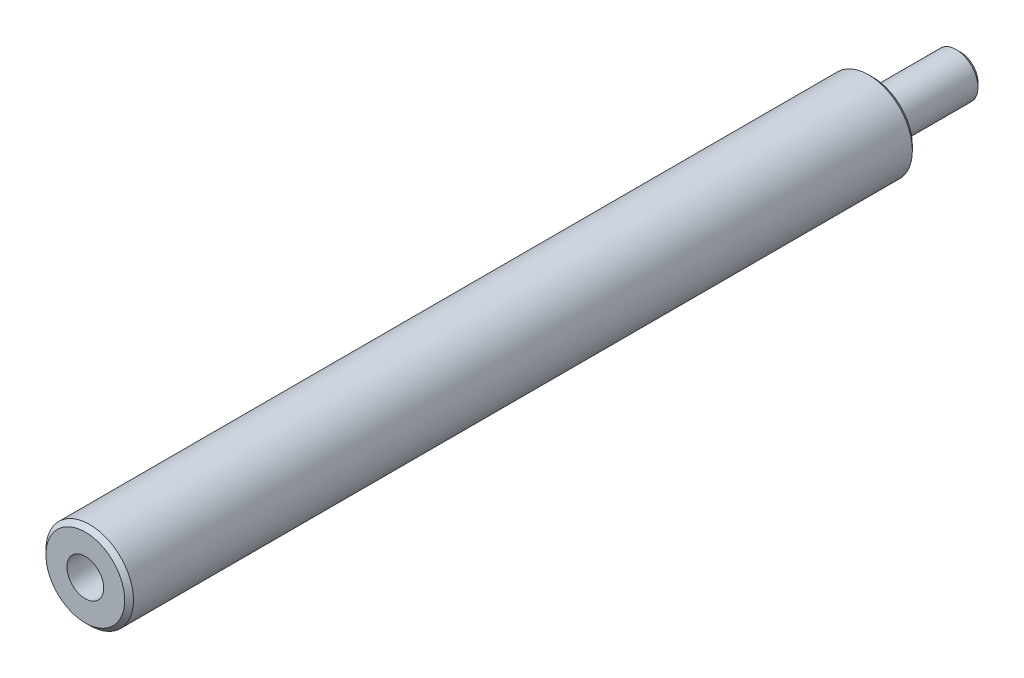
ISO-10303-21;
HEADER;
FILE_DESCRIPTION(('STEP AP214'),'2;1');
FILE_NAME('part.step','',(''),(''),'','','');
FILE_SCHEMA(('AUTOMOTIVE_DESIGN { 1 0 10303 214 1 1 1 1 }'));
ENDSEC;
DATA;
#1=APPLICATION_CONTEXT('core data for automotive mechanical design processes');
#2=APPLICATION_PROTOCOL_DEFINITION('international standard','automotive_design',2000,#1);
#3=PRODUCT_CONTEXT('',#1,'mechanical');
#4=PRODUCT('Part','Part','',(#3));
#5=PRODUCT_RELATED_PRODUCT_CATEGORY('part','',(#4));
#6=PRODUCT_DEFINITION_FORMATION('','',#4);
#7=PRODUCT_DEFINITION_CONTEXT('part definition',#1,'design');
#8=PRODUCT_DEFINITION('design','',#6,#7);
#9=PRODUCT_DEFINITION_SHAPE('','',#8);
#10=(LENGTH_UNIT() NAMED_UNIT(*) SI_UNIT(.MILLI.,.METRE.));
#11=(NAMED_UNIT(*) PLANE_ANGLE_UNIT() SI_UNIT($,.RADIAN.));
#12=(NAMED_UNIT(*) SI_UNIT($,.STERADIAN.) SOLID_ANGLE_UNIT());
#13=UNCERTAINTY_MEASURE_WITH_UNIT(LENGTH_MEASURE(1.E-05),#10,'distance_accuracy_value','');
#14=(GEOMETRIC_REPRESENTATION_CONTEXT(3) GLOBAL_UNCERTAINTY_ASSIGNED_CONTEXT((#13)) GLOBAL_UNIT_ASSIGNED_CONTEXT((#10,
#11,#12)) REPRESENTATION_CONTEXT('',''));
#15=CARTESIAN_POINT('',(0.,0.,0.));
#16=DIRECTION('',(0.,0.,1.));
#17=DIRECTION('',(1.,0.,0.));
#18=AXIS2_PLACEMENT_3D('',#15,#16,#17);
#19=CARTESIAN_POINT('',(0.,0.,90.));
#20=DIRECTION('',(0.,0.,-1.));
#21=DIRECTION('',(-1.,0.,0.));
#22=AXIS2_PLACEMENT_3D('',#19,#20,#21);
#23=CYLINDRICAL_SURFACE('',#22,5.);
#24=CARTESIAN_POINT('',(0.,0.,0.500000000000084));
#25=DIRECTION('',(0.,0.,1.));
#26=DIRECTION('',(1.,0.,0.));
#27=AXIS2_PLACEMENT_3D('',#24,#25,#26);
#28=CIRCLE('',#27,5.);
#29=CARTESIAN_POINT('',(5.,0.,0.500000000000084));
#30=VERTEX_POINT('',#29);
#31=EDGE_CURVE('E71',#30,#30,#28,.T.);
#32=ORIENTED_EDGE('',*,*,#31,.T.);
#33=EDGE_LOOP('',(#32));
#34=FACE_BOUND('',#33,.T.);
#35=CARTESIAN_POINT('',(0.,0.,89.5000000000001));
#36=DIRECTION('',(0.,0.,1.));
#37=DIRECTION('',(1.,0.,0.));
#38=AXIS2_PLACEMENT_3D('',#35,#36,#37);
#39=CIRCLE('',#38,5.);
#40=CARTESIAN_POINT('',(5.,0.,89.5000000000001));
#41=VERTEX_POINT('',#40);
#42=EDGE_CURVE('E68',#41,#41,#39,.F.);
#43=ORIENTED_EDGE('',*,*,#42,.T.);
#44=EDGE_LOOP('',(#43));
#45=FACE_BOUND('',#44,.T.);
#46=ADVANCED_FACE('F34',(#34,#45),#23,.T.);
#47=CARTESIAN_POINT('',(0.,0.,90.));
#48=DIRECTION('',(0.,0.,1.));
#49=DIRECTION('',(1.,0.,0.));
#50=AXIS2_PLACEMENT_3D('',#47,#48,#49);
#51=PLANE('',#50);
#52=CARTESIAN_POINT('',(0.,0.,90.));
#53=DIRECTION('',(0.,0.,1.));
#54=DIRECTION('',(1.,0.,0.));
#55=AXIS2_PLACEMENT_3D('',#52,#53,#54);
#56=CIRCLE('',#55,4.50000000000007);
#57=CARTESIAN_POINT('',(4.50000000000007,0.,90.));
#58=VERTEX_POINT('',#57);
#59=EDGE_CURVE('E11',#58,#58,#56,.T.);
#60=ORIENTED_EDGE('',*,*,#59,.T.);
#61=EDGE_LOOP('',(#60));
#62=FACE_BOUND('',#61,.T.);
#63=CARTESIAN_POINT('',(0.,0.,90.));
#64=DIRECTION('',(0.,0.,1.));
#65=DIRECTION('',(1.,0.,0.));
#66=AXIS2_PLACEMENT_3D('',#63,#64,#65);
#67=CIRCLE('',#66,2.1);
#68=CARTESIAN_POINT('',(2.1,0.,90.));
#69=VERTEX_POINT('',#68);
#70=EDGE_CURVE('E55',#69,#69,#67,.T.);
#71=ORIENTED_EDGE('',*,*,#70,.F.);
#72=EDGE_LOOP('',(#71));
#73=FACE_BOUND('',#72,.T.);
#74=ADVANCED_FACE('F87',(#62,#73),#51,.T.);
#75=CARTESIAN_POINT('',(0.,0.,0.));
#76=DIRECTION('',(0.,0.,1.));
#77=DIRECTION('',(1.,0.,0.));
#78=AXIS2_PLACEMENT_3D('',#75,#76,#77);
#79=PLANE('',#78);
#80=CARTESIAN_POINT('',(0.,0.,0.));
#81=DIRECTION('',(0.,0.,1.));
#82=DIRECTION('',(1.,0.,0.));
#83=AXIS2_PLACEMENT_3D('',#80,#81,#82);
#84=CIRCLE('',#83,4.49999999999991);
#85=CARTESIAN_POINT('',(4.49999999999991,0.,0.));
#86=VERTEX_POINT('',#85);
#87=EDGE_CURVE('E41',#86,#86,#84,.F.);
#88=ORIENTED_EDGE('',*,*,#87,.T.);
#89=EDGE_LOOP('',(#88));
#90=FACE_BOUND('',#89,.T.);
#91=CARTESIAN_POINT('',(0.,0.,0.));
#92=DIRECTION('',(0.,0.,-1.));
#93=DIRECTION('',(-1.,0.,0.));
#94=AXIS2_PLACEMENT_3D('',#91,#92,#93);
#95=CIRCLE('',#94,2.5);
#96=CARTESIAN_POINT('',(-2.5,0.,0.));
#97=VERTEX_POINT('',#96);
#98=EDGE_CURVE('E54',#97,#97,#95,.T.);
#99=ORIENTED_EDGE('',*,*,#98,.F.);
#100=EDGE_LOOP('',(#99));
#101=FACE_BOUND('',#100,.T.);
#102=ADVANCED_FACE('F76',(#90,#101),#79,.F.);
#103=CARTESIAN_POINT('',(0.,0.,-10.));
#104=DIRECTION('',(0.,0.,1.));
#105=DIRECTION('',(1.,0.,0.));
#106=AXIS2_PLACEMENT_3D('',#103,#104,#105);
#107=CYLINDRICAL_SURFACE('',#106,2.5);
#108=CARTESIAN_POINT('',(0.,0.,-9.49999999999999));
#109=DIRECTION('',(0.,0.,-1.));
#110=DIRECTION('',(-1.,0.,0.));
#111=AXIS2_PLACEMENT_3D('',#108,#109,#110);
#112=CIRCLE('',#111,2.5);
#113=CARTESIAN_POINT('',(-2.5,0.,-9.49999999999999));
#114=VERTEX_POINT('',#113);
#115=EDGE_CURVE('E65',#114,#114,#112,.F.);
#116=ORIENTED_EDGE('',*,*,#115,.T.);
#117=EDGE_LOOP('',(#116));
#118=FACE_BOUND('',#117,.T.);
#119=ORIENTED_EDGE('',*,*,#98,.T.);
#120=EDGE_LOOP('',(#119));
#121=FACE_BOUND('',#120,.T.);
#122=ADVANCED_FACE('F110',(#118,#121),#107,.T.);
#123=CARTESIAN_POINT('',(0.,0.,-10.));
#124=DIRECTION('',(0.,0.,-1.));
#125=DIRECTION('',(-1.,0.,0.));
#126=AXIS2_PLACEMENT_3D('',#123,#124,#125);
#127=PLANE('',#126);
#128=CARTESIAN_POINT('',(0.,0.,-10.));
#129=DIRECTION('',(0.,0.,-1.));
#130=DIRECTION('',(-1.,0.,0.));
#131=AXIS2_PLACEMENT_3D('',#128,#129,#130);
#132=CIRCLE('',#131,2.);
#133=CARTESIAN_POINT('',(-2.,0.,-10.));
#134=VERTEX_POINT('',#133);
#135=EDGE_CURVE('E58',#134,#134,#132,.T.);
#136=ORIENTED_EDGE('',*,*,#135,.T.);
#137=EDGE_LOOP('',(#136));
#138=FACE_BOUND('',#137,.T.);
#139=ADVANCED_FACE('F48',(#138),#127,.T.);
#140=CARTESIAN_POINT('',(0.,0.,80.));
#141=DIRECTION('',(0.,0.,1.));
#142=DIRECTION('',(1.,0.,0.));
#143=AXIS2_PLACEMENT_3D('',#140,#141,#142);
#144=CONICAL_SURFACE('',#143,2.1,1.02974425867665);
#145=CARTESIAN_POINT('',(0.,0.,78.7381927000421));
#146=VERTEX_POINT('',#145);
#147=VERTEX_LOOP('',#146);
#148=FACE_BOUND('',#147,.T.);
#149=CARTESIAN_POINT('',(0.,0.,80.));
#150=DIRECTION('',(0.,0.,1.));
#151=DIRECTION('',(1.,0.,0.));
#152=AXIS2_PLACEMENT_3D('',#149,#150,#151);
#153=CIRCLE('',#152,2.1);
#154=CARTESIAN_POINT('',(2.1,0.,80.));
#155=VERTEX_POINT('',#154);
#156=EDGE_CURVE('E52',#155,#155,#153,.T.);
#157=ORIENTED_EDGE('',*,*,#156,.T.);
#158=EDGE_LOOP('',(#157));
#159=FACE_BOUND('',#158,.T.);
#160=ADVANCED_FACE('F44',(#148,#159),#144,.F.);
#161=CARTESIAN_POINT('',(0.,0.,90.));
#162=DIRECTION('',(0.,0.,1.));
#163=DIRECTION('',(1.,0.,0.));
#164=AXIS2_PLACEMENT_3D('',#161,#162,#163);
#165=CYLINDRICAL_SURFACE('',#164,2.1);
#166=ORIENTED_EDGE('',*,*,#156,.F.);
#167=EDGE_LOOP('',(#166));
#168=FACE_BOUND('',#167,.T.);
#169=ORIENTED_EDGE('',*,*,#70,.T.);
#170=EDGE_LOOP('',(#169));
#171=FACE_BOUND('',#170,.T.);
#172=ADVANCED_FACE('F47',(#168,#171),#165,.F.);
#173=CARTESIAN_POINT('',(0.,0.,-10.));
#174=DIRECTION('',(0.,0.,1.));
#175=DIRECTION('',(1.,0.,0.));
#176=AXIS2_PLACEMENT_3D('',#173,#174,#175);
#177=CONICAL_SURFACE('',#176,2.,0.78539816339744);
#178=ORIENTED_EDGE('',*,*,#115,.F.);
#179=EDGE_LOOP('',(#178));
#180=FACE_BOUND('',#179,.T.);
#181=ORIENTED_EDGE('',*,*,#135,.F.);
#182=EDGE_LOOP('',(#181));
#183=FACE_BOUND('',#182,.T.);
#184=ADVANCED_FACE('F82',(#180,#183),#177,.T.);
#185=CARTESIAN_POINT('',(0.,0.,0.500000000000084));
#186=DIRECTION('',(0.,0.,1.));
#187=DIRECTION('',(1.,0.,0.));
#188=AXIS2_PLACEMENT_3D('',#185,#186,#187);
#189=CONICAL_SURFACE('',#188,5.,0.785398163397459);
#190=ORIENTED_EDGE('',*,*,#87,.F.);
#191=EDGE_LOOP('',(#190));
#192=FACE_BOUND('',#191,.T.);
#193=ORIENTED_EDGE('',*,*,#31,.F.);
#194=EDGE_LOOP('',(#193));
#195=FACE_BOUND('',#194,.T.);
#196=ADVANCED_FACE('F79',(#192,#195),#189,.T.);
#197=CARTESIAN_POINT('',(0.,0.,90.));
#198=DIRECTION('',(0.,0.,-1.));
#199=DIRECTION('',(-1.,0.,0.));
#200=AXIS2_PLACEMENT_3D('',#197,#198,#199);
#201=CONICAL_SURFACE('',#200,4.50000000000007,0.785398163397445);
#202=ORIENTED_EDGE('',*,*,#42,.F.);
#203=EDGE_LOOP('',(#202));
#204=FACE_BOUND('',#203,.T.);
#205=ORIENTED_EDGE('',*,*,#59,.F.);
#206=EDGE_LOOP('',(#205));
#207=FACE_BOUND('',#206,.T.);
#208=ADVANCED_FACE('F36',(#204,#207),#201,.T.);
#209=CLOSED_SHELL('',(#46,#74,#102,#122,#139,#160,#172,#184,#196,#208));
#210=MANIFOLD_SOLID_BREP('B2',#209);
#211=ADVANCED_BREP_SHAPE_REPRESENTATION('',(#18,#210),#14);
#212=SHAPE_DEFINITION_REPRESENTATION(#9,#211);
ENDSEC;
END-ISO-10303-21;
